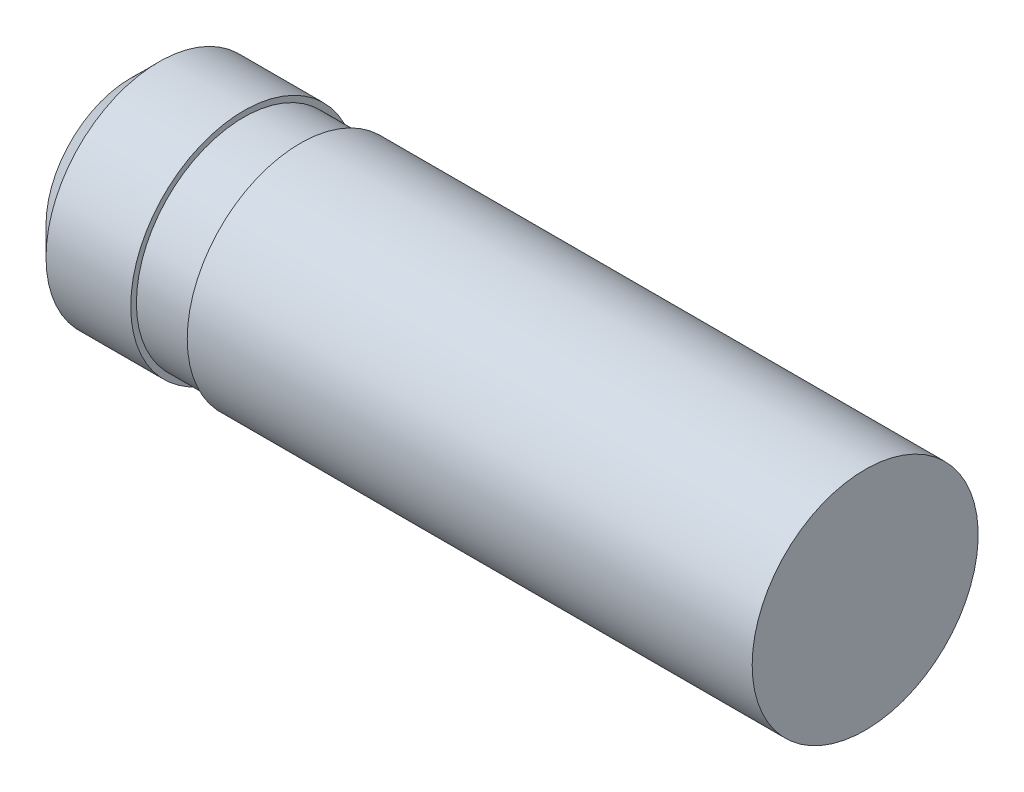
ISO-10303-21;
HEADER;
FILE_DESCRIPTION(('STEP AP214'),'2;1');
FILE_NAME('part.step','',(''),(''),'','','');
FILE_SCHEMA(('AUTOMOTIVE_DESIGN { 1 0 10303 214 1 1 1 1 }'));
ENDSEC;
DATA;
#1=APPLICATION_CONTEXT('core data for automotive mechanical design processes');
#2=APPLICATION_PROTOCOL_DEFINITION('international standard','automotive_design',2000,#1);
#3=PRODUCT_CONTEXT('',#1,'mechanical');
#4=PRODUCT('Part','Part','',(#3));
#5=PRODUCT_RELATED_PRODUCT_CATEGORY('part','',(#4));
#6=PRODUCT_DEFINITION_FORMATION('','',#4);
#7=PRODUCT_DEFINITION_CONTEXT('part definition',#1,'design');
#8=PRODUCT_DEFINITION('design','',#6,#7);
#9=PRODUCT_DEFINITION_SHAPE('','',#8);
#10=(LENGTH_UNIT() NAMED_UNIT(*) SI_UNIT(.MILLI.,.METRE.));
#11=(NAMED_UNIT(*) PLANE_ANGLE_UNIT() SI_UNIT($,.RADIAN.));
#12=(NAMED_UNIT(*) SI_UNIT($,.STERADIAN.) SOLID_ANGLE_UNIT());
#13=UNCERTAINTY_MEASURE_WITH_UNIT(LENGTH_MEASURE(1.E-05),#10,'distance_accuracy_value','');
#14=(GEOMETRIC_REPRESENTATION_CONTEXT(3) GLOBAL_UNCERTAINTY_ASSIGNED_CONTEXT((#13)) GLOBAL_UNIT_ASSIGNED_CONTEXT((#10,
#11,#12)) REPRESENTATION_CONTEXT('',''));
#15=CARTESIAN_POINT('',(0.,0.,0.));
#16=DIRECTION('',(0.,0.,1.));
#17=DIRECTION('',(1.,0.,0.));
#18=AXIS2_PLACEMENT_3D('',#15,#16,#17);
#19=CARTESIAN_POINT('',(0.,0.,0.));
#20=DIRECTION('',(1.,0.,0.));
#21=DIRECTION('',(0.,0.,-1.));
#22=AXIS2_PLACEMENT_3D('',#19,#20,#21);
#23=PLANE('',#22);
#24=CARTESIAN_POINT('',(0.,0.,0.));
#25=DIRECTION('',(-1.,0.,0.));
#26=DIRECTION('',(0.,0.,1.));
#27=AXIS2_PLACEMENT_3D('',#24,#25,#26);
#28=CIRCLE('',#27,1.5);
#29=CARTESIAN_POINT('',(0.,0.,1.5));
#30=VERTEX_POINT('',#29);
#31=EDGE_CURVE('E10',#30,#30,#28,.T.);
#32=ORIENTED_EDGE('',*,*,#31,.T.);
#33=EDGE_LOOP('',(#32));
#34=FACE_BOUND('',#33,.T.);
#35=ADVANCED_FACE('F37',(#34),#23,.F.);
#36=CARTESIAN_POINT('',(0.500000000000002,0.,0.));
#37=DIRECTION('',(1.,0.,0.));
#38=DIRECTION('',(0.,0.,-1.));
#39=AXIS2_PLACEMENT_3D('',#36,#37,#38);
#40=CONICAL_SURFACE('',#39,2.,0.785398163397447);
#41=ORIENTED_EDGE('',*,*,#31,.F.);
#42=EDGE_LOOP('',(#41));
#43=FACE_BOUND('',#42,.T.);
#44=CARTESIAN_POINT('',(0.500000000000002,0.,0.));
#45=DIRECTION('',(-1.,0.,0.));
#46=DIRECTION('',(0.,0.,1.));
#47=AXIS2_PLACEMENT_3D('',#44,#45,#46);
#48=CIRCLE('',#47,2.);
#49=CARTESIAN_POINT('',(0.500000000000002,0.,2.));
#50=VERTEX_POINT('',#49);
#51=EDGE_CURVE('E43',#50,#50,#48,.T.);
#52=ORIENTED_EDGE('',*,*,#51,.T.);
#53=EDGE_LOOP('',(#52));
#54=FACE_BOUND('',#53,.T.);
#55=ADVANCED_FACE('F78',(#43,#54),#40,.T.);
#56=CARTESIAN_POINT('',(0.,0.,0.));
#57=DIRECTION('',(-1.,0.,0.));
#58=DIRECTION('',(0.,0.,1.));
#59=AXIS2_PLACEMENT_3D('',#56,#57,#58);
#60=CYLINDRICAL_SURFACE('',#59,2.);
#61=ORIENTED_EDGE('',*,*,#51,.F.);
#62=EDGE_LOOP('',(#61));
#63=FACE_BOUND('',#62,.T.);
#64=CARTESIAN_POINT('',(2.,0.,0.));
#65=DIRECTION('',(-1.,0.,0.));
#66=DIRECTION('',(0.,0.,1.));
#67=AXIS2_PLACEMENT_3D('',#64,#65,#66);
#68=CIRCLE('',#67,2.);
#69=CARTESIAN_POINT('',(2.,0.,2.));
#70=VERTEX_POINT('',#69);
#71=EDGE_CURVE('E47',#70,#70,#68,.T.);
#72=ORIENTED_EDGE('',*,*,#71,.T.);
#73=EDGE_LOOP('',(#72));
#74=FACE_BOUND('',#73,.T.);
#75=ADVANCED_FACE('F82',(#63,#74),#60,.T.);
#76=CARTESIAN_POINT('',(2.,2.,0.));
#77=DIRECTION('',(-1.,0.,0.));
#78=DIRECTION('',(0.,0.,1.));
#79=AXIS2_PLACEMENT_3D('',#76,#77,#78);
#80=PLANE('',#79);
#81=ORIENTED_EDGE('',*,*,#71,.F.);
#82=EDGE_LOOP('',(#81));
#83=FACE_BOUND('',#82,.T.);
#84=CARTESIAN_POINT('',(2.,0.,0.));
#85=DIRECTION('',(-1.,0.,0.));
#86=DIRECTION('',(0.,0.,1.));
#87=AXIS2_PLACEMENT_3D('',#84,#85,#86);
#88=CIRCLE('',#87,1.9);
#89=CARTESIAN_POINT('',(2.,0.,1.9));
#90=VERTEX_POINT('',#89);
#91=EDGE_CURVE('E51',#90,#90,#88,.T.);
#92=ORIENTED_EDGE('',*,*,#91,.T.);
#93=EDGE_LOOP('',(#92));
#94=FACE_BOUND('',#93,.T.);
#95=ADVANCED_FACE('F87',(#83,#94),#80,.F.);
#96=CARTESIAN_POINT('',(0.,0.,0.));
#97=DIRECTION('',(-1.,0.,0.));
#98=DIRECTION('',(0.,0.,1.));
#99=AXIS2_PLACEMENT_3D('',#96,#97,#98);
#100=CYLINDRICAL_SURFACE('',#99,1.9);
#101=ORIENTED_EDGE('',*,*,#91,.F.);
#102=EDGE_LOOP('',(#101));
#103=FACE_BOUND('',#102,.T.);
#104=CARTESIAN_POINT('',(3.,0.,0.));
#105=DIRECTION('',(-1.,0.,0.));
#106=DIRECTION('',(0.,0.,1.));
#107=AXIS2_PLACEMENT_3D('',#104,#105,#106);
#108=CIRCLE('',#107,1.9);
#109=CARTESIAN_POINT('',(3.,0.,1.9));
#110=VERTEX_POINT('',#109);
#111=EDGE_CURVE('E56',#110,#110,#108,.T.);
#112=ORIENTED_EDGE('',*,*,#111,.T.);
#113=EDGE_LOOP('',(#112));
#114=FACE_BOUND('',#113,.T.);
#115=ADVANCED_FACE('F93',(#103,#114),#100,.T.);
#116=CARTESIAN_POINT('',(3.,2.,0.));
#117=DIRECTION('',(1.,0.,0.));
#118=DIRECTION('',(0.,0.,-1.));
#119=AXIS2_PLACEMENT_3D('',#116,#117,#118);
#120=PLANE('',#119);
#121=ORIENTED_EDGE('',*,*,#111,.F.);
#122=EDGE_LOOP('',(#121));
#123=FACE_BOUND('',#122,.T.);
#124=CARTESIAN_POINT('',(3.,0.,0.));
#125=DIRECTION('',(-1.,0.,0.));
#126=DIRECTION('',(0.,0.,1.));
#127=AXIS2_PLACEMENT_3D('',#124,#125,#126);
#128=CIRCLE('',#127,2.);
#129=CARTESIAN_POINT('',(3.,0.,2.));
#130=VERTEX_POINT('',#129);
#131=EDGE_CURVE('E59',#130,#130,#128,.T.);
#132=ORIENTED_EDGE('',*,*,#131,.T.);
#133=EDGE_LOOP('',(#132));
#134=FACE_BOUND('',#133,.T.);
#135=ADVANCED_FACE('F74',(#123,#134),#120,.F.);
#136=CARTESIAN_POINT('',(0.,0.,0.));
#137=DIRECTION('',(-1.,0.,0.));
#138=DIRECTION('',(0.,0.,1.));
#139=AXIS2_PLACEMENT_3D('',#136,#137,#138);
#140=CYLINDRICAL_SURFACE('',#139,2.);
#141=ORIENTED_EDGE('',*,*,#131,.F.);
#142=EDGE_LOOP('',(#141));
#143=FACE_BOUND('',#142,.T.);
#144=CARTESIAN_POINT('',(13.,0.,0.));
#145=DIRECTION('',(-1.,0.,0.));
#146=DIRECTION('',(0.,0.,1.));
#147=AXIS2_PLACEMENT_3D('',#144,#145,#146);
#148=CIRCLE('',#147,2.);
#149=CARTESIAN_POINT('',(13.,0.,2.));
#150=VERTEX_POINT('',#149);
#151=EDGE_CURVE('E62',#150,#150,#148,.T.);
#152=ORIENTED_EDGE('',*,*,#151,.T.);
#153=EDGE_LOOP('',(#152));
#154=FACE_BOUND('',#153,.T.);
#155=ADVANCED_FACE('F66',(#143,#154),#140,.T.);
#156=CARTESIAN_POINT('',(13.,2.,0.));
#157=DIRECTION('',(-1.,0.,0.));
#158=DIRECTION('',(0.,0.,1.));
#159=AXIS2_PLACEMENT_3D('',#156,#157,#158);
#160=PLANE('',#159);
#161=ORIENTED_EDGE('',*,*,#151,.F.);
#162=EDGE_LOOP('',(#161));
#163=FACE_BOUND('',#162,.T.);
#164=ADVANCED_FACE('F68',(#163),#160,.F.);
#165=CLOSED_SHELL('',(#35,#55,#75,#95,#115,#135,#155,#164));
#166=MANIFOLD_SOLID_BREP('B2',#165);
#167=ADVANCED_BREP_SHAPE_REPRESENTATION('',(#18,#166),#14);
#168=SHAPE_DEFINITION_REPRESENTATION(#9,#167);
ENDSEC;
END-ISO-10303-21;
